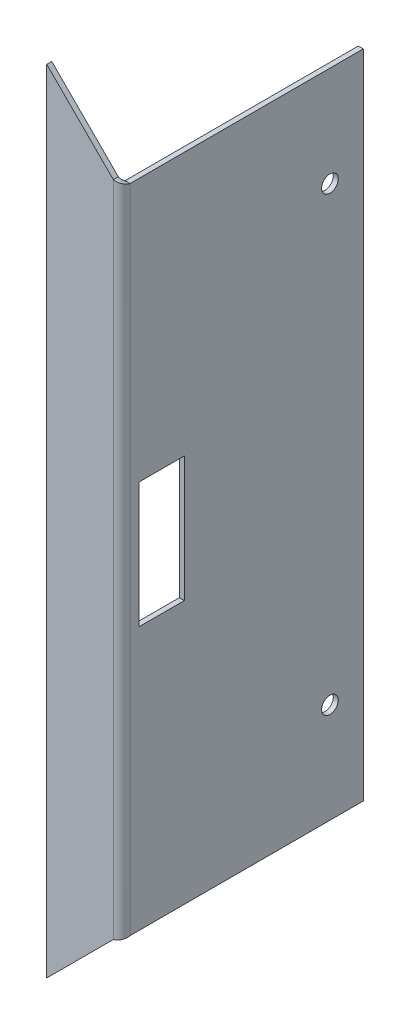
ISO-10303-21;
HEADER;
FILE_DESCRIPTION(('STEP AP214'),'2;1');
FILE_NAME('part.step','',(''),(''),'','','');
FILE_SCHEMA(('AUTOMOTIVE_DESIGN { 1 0 10303 214 1 1 1 1 }'));
ENDSEC;
DATA;
#1=APPLICATION_CONTEXT('core data for automotive mechanical design processes');
#2=APPLICATION_PROTOCOL_DEFINITION('international standard','automotive_design',2000,#1);
#3=PRODUCT_CONTEXT('',#1,'mechanical');
#4=PRODUCT('Part','Part','',(#3));
#5=PRODUCT_RELATED_PRODUCT_CATEGORY('part','',(#4));
#6=PRODUCT_DEFINITION_FORMATION('','',#4);
#7=PRODUCT_DEFINITION_CONTEXT('part definition',#1,'design');
#8=PRODUCT_DEFINITION('design','',#6,#7);
#9=PRODUCT_DEFINITION_SHAPE('','',#8);
#10=(LENGTH_UNIT() NAMED_UNIT(*) SI_UNIT(.MILLI.,.METRE.));
#11=(NAMED_UNIT(*) PLANE_ANGLE_UNIT() SI_UNIT($,.RADIAN.));
#12=(NAMED_UNIT(*) SI_UNIT($,.STERADIAN.) SOLID_ANGLE_UNIT());
#13=UNCERTAINTY_MEASURE_WITH_UNIT(LENGTH_MEASURE(1.E-05),#10,'distance_accuracy_value','');
#14=(GEOMETRIC_REPRESENTATION_CONTEXT(3) GLOBAL_UNCERTAINTY_ASSIGNED_CONTEXT((#13)) GLOBAL_UNIT_ASSIGNED_CONTEXT((#10,
#11,#12)) REPRESENTATION_CONTEXT('',''));
#15=CARTESIAN_POINT('',(0.,0.,0.));
#16=DIRECTION('',(0.,0.,1.));
#17=DIRECTION('',(1.,0.,0.));
#18=AXIS2_PLACEMENT_3D('',#15,#16,#17);
#19=CARTESIAN_POINT('',(366.499995353665,42.4999999999998,-5.93079247326395E-13));
#20=DIRECTION('',(0.,0.,1.));
#21=DIRECTION('',(1.,0.,0.));
#22=AXIS2_PLACEMENT_3D('',#19,#20,#21);
#23=PLANE('',#22);
#24=DIRECTION('',(0.,1.,0.));
#25=VECTOR('',#24,1.);
#26=CARTESIAN_POINT('',(364.999995353665,42.4999999999998,-5.98200821102928E-13));
#27=LINE('',#26,#25);
#28=CARTESIAN_POINT('',(364.999995353665,42.4999999999998,-5.98200821102928E-13));
#29=VERTEX_POINT('',#28);
#30=CARTESIAN_POINT('',(364.999995353665,238.,-5.98200821102928E-13));
#31=VERTEX_POINT('',#30);
#32=EDGE_CURVE('E237',#29,#31,#27,.T.);
#33=ORIENTED_EDGE('',*,*,#32,.T.);
#34=DIRECTION('',(-1.,0.,0.));
#35=VECTOR('',#34,1.);
#36=CARTESIAN_POINT('',(366.499995353665,238.,-5.93079247326395E-13));
#37=LINE('',#36,#35);
#38=CARTESIAN_POINT('',(366.499995353665,238.,-5.93079247326395E-13));
#39=VERTEX_POINT('',#38);
#40=EDGE_CURVE('E13',#39,#31,#37,.T.);
#41=ORIENTED_EDGE('',*,*,#40,.F.);
#42=DIRECTION('',(0.,1.,0.));
#43=VECTOR('',#42,1.);
#44=CARTESIAN_POINT('',(366.499995353665,42.4999999999998,-5.93079247326395E-13));
#45=LINE('',#44,#43);
#46=CARTESIAN_POINT('',(366.499995353665,42.4999999999998,-5.93079247326395E-13));
#47=VERTEX_POINT('',#46);
#48=EDGE_CURVE('E277',#47,#39,#45,.T.);
#49=ORIENTED_EDGE('',*,*,#48,.F.);
#50=DIRECTION('',(-1.,0.,0.));
#51=VECTOR('',#50,1.);
#52=CARTESIAN_POINT('',(366.499995353665,42.4999999999998,-5.93079247326395E-13));
#53=LINE('',#52,#51);
#54=EDGE_CURVE('E325',#47,#29,#53,.T.);
#55=ORIENTED_EDGE('',*,*,#54,.T.);
#56=EDGE_LOOP('',(#33,#41,#49,#55));
#57=FACE_BOUND('',#56,.T.);
#58=ADVANCED_FACE('F59',(#57),#23,.F.);
#59=CARTESIAN_POINT('',(366.499995353665,238.,-5.93079247326395E-13));
#60=DIRECTION('',(0.,-1.,0.));
#61=DIRECTION('',(0.,0.,-1.));
#62=AXIS2_PLACEMENT_3D('',#59,#60,#61);
#63=PLANE('',#62);
#64=DIRECTION('',(0.,0.,1.));
#65=VECTOR('',#64,1.);
#66=CARTESIAN_POINT('',(364.999995353665,238.,-5.98200821102928E-13));
#67=LINE('',#66,#65);
#68=CARTESIAN_POINT('',(364.999995353665,238.,70.));
#69=VERTEX_POINT('',#68);
#70=EDGE_CURVE('E309',#31,#69,#67,.T.);
#71=ORIENTED_EDGE('',*,*,#70,.T.);
#72=DIRECTION('',(-1.,0.,0.));
#73=VECTOR('',#72,1.);
#74=CARTESIAN_POINT('',(366.499995353665,238.,70.));
#75=LINE('',#74,#73);
#76=CARTESIAN_POINT('',(366.499995353665,238.,70.));
#77=VERTEX_POINT('',#76);
#78=EDGE_CURVE('E66',#77,#69,#75,.T.);
#79=ORIENTED_EDGE('',*,*,#78,.F.);
#80=DIRECTION('',(0.,0.,1.));
#81=VECTOR('',#80,1.);
#82=CARTESIAN_POINT('',(366.499995353665,238.,-5.93079247326395E-13));
#83=LINE('',#82,#81);
#84=EDGE_CURVE('E359',#39,#77,#83,.T.);
#85=ORIENTED_EDGE('',*,*,#84,.F.);
#86=ORIENTED_EDGE('',*,*,#40,.T.);
#87=EDGE_LOOP('',(#71,#79,#85,#86));
#88=FACE_BOUND('',#87,.T.);
#89=ADVANCED_FACE('F299',(#88),#63,.F.);
#90=CARTESIAN_POINT('',(366.499995353665,42.4999999999998,-5.93079247326395E-13));
#91=DIRECTION('',(0.,1.,0.));
#92=DIRECTION('',(0.,0.,1.));
#93=AXIS2_PLACEMENT_3D('',#90,#91,#92);
#94=PLANE('',#93);
#95=DIRECTION('',(0.,0.,-1.));
#96=VECTOR('',#95,1.);
#97=CARTESIAN_POINT('',(364.999995353665,42.4999999999998,-5.98200821102928E-13));
#98=LINE('',#97,#96);
#99=CARTESIAN_POINT('',(364.999995353665,42.4999999999998,70.));
#100=VERTEX_POINT('',#99);
#101=EDGE_CURVE('E318',#100,#29,#98,.T.);
#102=ORIENTED_EDGE('',*,*,#101,.T.);
#103=ORIENTED_EDGE('',*,*,#54,.F.);
#104=DIRECTION('',(0.,0.,-1.));
#105=VECTOR('',#104,1.);
#106=CARTESIAN_POINT('',(366.499995353665,42.4999999999998,-5.93079247326395E-13));
#107=LINE('',#106,#105);
#108=CARTESIAN_POINT('',(366.499995353665,42.4999999999998,70.));
#109=VERTEX_POINT('',#108);
#110=EDGE_CURVE('E329',#109,#47,#107,.T.);
#111=ORIENTED_EDGE('',*,*,#110,.F.);
#112=DIRECTION('',(-1.,0.,0.));
#113=VECTOR('',#112,1.);
#114=CARTESIAN_POINT('',(366.499995353665,42.4999999999998,70.));
#115=LINE('',#114,#113);
#116=EDGE_CURVE('E328',#109,#100,#115,.T.);
#117=ORIENTED_EDGE('',*,*,#116,.T.);
#118=EDGE_LOOP('',(#102,#103,#111,#117));
#119=FACE_BOUND('',#118,.T.);
#120=ADVANCED_FACE('F294',(#119),#94,.F.);
#121=CARTESIAN_POINT('',(366.499995353665,0.,1.45237656959693E-12));
#122=DIRECTION('',(1.,0.,0.));
#123=DIRECTION('',(0.,0.,-1.));
#124=AXIS2_PLACEMENT_3D('',#121,#122,#123);
#125=PLANE('',#124);
#126=DIRECTION('',(0.,0.,1.));
#127=VECTOR('',#126,1.);
#128=CARTESIAN_POINT('',(366.499995353665,159.05,53.6999999999928));
#129=LINE('',#128,#127);
#130=CARTESIAN_POINT('',(366.499995353665,159.05,53.6999999999928));
#131=VERTEX_POINT('',#130);
#132=CARTESIAN_POINT('',(366.499995353665,159.05,67.2999999999928));
#133=VERTEX_POINT('',#132);
#134=EDGE_CURVE('E73',#131,#133,#129,.T.);
#135=ORIENTED_EDGE('',*,*,#134,.F.);
#136=DIRECTION('',(0.,1.,0.));
#137=VECTOR('',#136,1.);
#138=CARTESIAN_POINT('',(366.499995353665,121.45,53.6999999999928));
#139=LINE('',#138,#137);
#140=CARTESIAN_POINT('',(366.499995353665,121.45,53.6999999999928));
#141=VERTEX_POINT('',#140);
#142=EDGE_CURVE('E165',#141,#131,#139,.T.);
#143=ORIENTED_EDGE('',*,*,#142,.F.);
#144=DIRECTION('',(0.,0.,-1.));
#145=VECTOR('',#144,1.);
#146=CARTESIAN_POINT('',(366.499995353665,121.45,67.2999999999928));
#147=LINE('',#146,#145);
#148=CARTESIAN_POINT('',(366.499995353665,121.45,67.2999999999928));
#149=VERTEX_POINT('',#148);
#150=EDGE_CURVE('E168',#149,#141,#147,.T.);
#151=ORIENTED_EDGE('',*,*,#150,.F.);
#152=DIRECTION('',(0.,-1.,0.));
#153=VECTOR('',#152,1.);
#154=CARTESIAN_POINT('',(366.499995353665,159.05,67.2999999999928));
#155=LINE('',#154,#153);
#156=EDGE_CURVE('E174',#133,#149,#155,.T.);
#157=ORIENTED_EDGE('',*,*,#156,.F.);
#158=EDGE_LOOP('',(#135,#143,#151,#157));
#159=FACE_BOUND('',#158,.T.);
#160=CARTESIAN_POINT('',(366.499995353665,208.,10.0000000000015));
#161=DIRECTION('',(1.,0.,0.));
#162=DIRECTION('',(0.,0.,-1.));
#163=AXIS2_PLACEMENT_3D('',#160,#161,#162);
#164=CIRCLE('',#163,2.5);
#165=CARTESIAN_POINT('',(366.499995353665,208.,7.50000000000145));
#166=VERTEX_POINT('',#165);
#167=EDGE_CURVE('E188',#166,#166,#164,.T.);
#168=ORIENTED_EDGE('',*,*,#167,.F.);
#169=EDGE_LOOP('',(#168));
#170=FACE_BOUND('',#169,.T.);
#171=CARTESIAN_POINT('',(366.499995353665,72.4999999999998,10.0000000000015));
#172=DIRECTION('',(1.,0.,0.));
#173=DIRECTION('',(0.,0.,1.));
#174=AXIS2_PLACEMENT_3D('',#171,#172,#173);
#175=CIRCLE('',#174,2.5);
#176=CARTESIAN_POINT('',(366.499995353665,72.4999999999998,12.5000000000015));
#177=VERTEX_POINT('',#176);
#178=EDGE_CURVE('E180',#177,#177,#175,.T.);
#179=ORIENTED_EDGE('',*,*,#178,.F.);
#180=EDGE_LOOP('',(#179));
#181=FACE_BOUND('',#180,.T.);
#182=ORIENTED_EDGE('',*,*,#48,.T.);
#183=ORIENTED_EDGE('',*,*,#84,.T.);
#184=DIRECTION('',(0.,-1.,0.));
#185=VECTOR('',#184,1.);
#186=CARTESIAN_POINT('',(366.499995353665,42.4999999999998,70.));
#187=LINE('',#186,#185);
#188=EDGE_CURVE('E356',#77,#109,#187,.T.);
#189=ORIENTED_EDGE('',*,*,#188,.T.);
#190=ORIENTED_EDGE('',*,*,#110,.T.);
#191=EDGE_LOOP('',(#182,#183,#189,#190));
#192=FACE_BOUND('',#191,.T.);
#193=ADVANCED_FACE('F285',(#159,#170,#181,#192),#125,.T.);
#194=CARTESIAN_POINT('',(364.999995353665,0.,1.44725499582039E-12));
#195=DIRECTION('',(1.,0.,0.));
#196=DIRECTION('',(0.,0.,-1.));
#197=AXIS2_PLACEMENT_3D('',#194,#195,#196);
#198=PLANE('',#197);
#199=DIRECTION('',(0.,1.,0.));
#200=VECTOR('',#199,1.);
#201=CARTESIAN_POINT('',(364.999995353665,121.45,53.6999999999928));
#202=LINE('',#201,#200);
#203=CARTESIAN_POINT('',(364.999995353665,121.45,53.6999999999928));
#204=VERTEX_POINT('',#203);
#205=CARTESIAN_POINT('',(364.999995353665,159.05,53.6999999999928));
#206=VERTEX_POINT('',#205);
#207=EDGE_CURVE('E155',#204,#206,#202,.T.);
#208=ORIENTED_EDGE('',*,*,#207,.T.);
#209=DIRECTION('',(0.,0.,1.));
#210=VECTOR('',#209,1.);
#211=CARTESIAN_POINT('',(364.999995353665,159.05,53.6999999999928));
#212=LINE('',#211,#210);
#213=CARTESIAN_POINT('',(364.999995353665,159.05,67.2999999999928));
#214=VERTEX_POINT('',#213);
#215=EDGE_CURVE('E149',#206,#214,#212,.T.);
#216=ORIENTED_EDGE('',*,*,#215,.T.);
#217=DIRECTION('',(0.,-1.,0.));
#218=VECTOR('',#217,1.);
#219=CARTESIAN_POINT('',(364.999995353665,159.05,67.2999999999928));
#220=LINE('',#219,#218);
#221=CARTESIAN_POINT('',(364.999995353665,121.45,67.2999999999928));
#222=VERTEX_POINT('',#221);
#223=EDGE_CURVE('E158',#214,#222,#220,.T.);
#224=ORIENTED_EDGE('',*,*,#223,.T.);
#225=DIRECTION('',(0.,0.,-1.));
#226=VECTOR('',#225,1.);
#227=CARTESIAN_POINT('',(364.999995353665,121.45,67.2999999999928));
#228=LINE('',#227,#226);
#229=EDGE_CURVE('E81',#222,#204,#228,.T.);
#230=ORIENTED_EDGE('',*,*,#229,.T.);
#231=EDGE_LOOP('',(#208,#216,#224,#230));
#232=FACE_BOUND('',#231,.T.);
#233=CARTESIAN_POINT('',(364.999995353665,208.,10.0000000000014));
#234=DIRECTION('',(1.,0.,0.));
#235=DIRECTION('',(0.,0.,-1.));
#236=AXIS2_PLACEMENT_3D('',#233,#234,#235);
#237=CIRCLE('',#236,2.5);
#238=CARTESIAN_POINT('',(364.999995353665,208.,7.50000000000145));
#239=VERTEX_POINT('',#238);
#240=EDGE_CURVE('E184',#239,#239,#237,.T.);
#241=ORIENTED_EDGE('',*,*,#240,.T.);
#242=EDGE_LOOP('',(#241));
#243=FACE_BOUND('',#242,.T.);
#244=CARTESIAN_POINT('',(364.999995353665,72.4999999999998,10.0000000000014));
#245=DIRECTION('',(1.,0.,0.));
#246=DIRECTION('',(0.,0.,1.));
#247=AXIS2_PLACEMENT_3D('',#244,#245,#246);
#248=CIRCLE('',#247,2.5);
#249=CARTESIAN_POINT('',(364.999995353665,72.4999999999998,12.5000000000014));
#250=VERTEX_POINT('',#249);
#251=EDGE_CURVE('E191',#250,#250,#248,.T.);
#252=ORIENTED_EDGE('',*,*,#251,.T.);
#253=EDGE_LOOP('',(#252));
#254=FACE_BOUND('',#253,.T.);
#255=ORIENTED_EDGE('',*,*,#32,.F.);
#256=ORIENTED_EDGE('',*,*,#101,.F.);
#257=DIRECTION('',(0.,-1.,0.));
#258=VECTOR('',#257,1.);
#259=CARTESIAN_POINT('',(364.999995353665,42.4999999999998,70.));
#260=LINE('',#259,#258);
#261=EDGE_CURVE('E315',#69,#100,#260,.T.);
#262=ORIENTED_EDGE('',*,*,#261,.F.);
#263=ORIENTED_EDGE('',*,*,#70,.F.);
#264=EDGE_LOOP('',(#255,#256,#262,#263));
#265=FACE_BOUND('',#264,.T.);
#266=ADVANCED_FACE('F162',(#232,#243,#254,#265),#198,.F.);
#267=CARTESIAN_POINT('',(366.514995353665,42.4999999999998,70.));
#268=CARTESIAN_POINT('',(366.514995353665,42.4166525226702,70.3292685254162));
#269=CARTESIAN_POINT('',(366.449536635485,42.3333333333331,70.6582959291636));
#270=CARTESIAN_POINT('',(366.197568120376,42.1666666666665,71.2666017356328));
#271=CARTESIAN_POINT('',(366.011157462296,42.0833333333331,71.5455850007369));
#272=CARTESIAN_POINT('',(365.545580354402,41.9166666666665,72.0111621086314));
#273=CARTESIAN_POINT('',(365.266597089298,41.8333333333331,72.1975727667109));
#274=CARTESIAN_POINT('',(364.658291282828,41.6666666666665,72.4495412818208));
#275=CARTESIAN_POINT('',(364.329263879081,41.5833474773294,72.515));
#276=CARTESIAN_POINT('',(363.999995353665,41.4999999999998,72.515));
#277=CARTESIAN_POINT('',(366.499995353665,42.4999999999998,70.));
#278=CARTESIAN_POINT('',(366.499995353665,42.4166525568521,70.3273046438602));
#279=CARTESIAN_POINT('',(366.434927045335,42.3333333333331,70.6543697108982));
#280=CARTESIAN_POINT('',(366.18446132455,42.1666666666665,71.2590474509273));
#281=CARTESIAN_POINT('',(365.99916245966,42.0833333333331,71.5363667999373));
#282=CARTESIAN_POINT('',(365.536362153602,41.9166666666665,71.9991671059954));
#283=CARTESIAN_POINT('',(365.259042804592,41.8333333333331,72.1844659708856));
#284=CARTESIAN_POINT('',(364.654365064563,41.6666666666665,72.4349316916708));
#285=CARTESIAN_POINT('',(364.327299997525,41.5833474431475,72.5));
#286=CARTESIAN_POINT('',(363.999995353665,41.4999999999998,72.5));
#287=CARTESIAN_POINT('',(364.999995353665,42.4999999999998,70.));
#288=CARTESIAN_POINT('',(364.999995353665,42.4166559750445,70.1309164882601));
#289=CARTESIAN_POINT('',(364.973968030333,42.3333333333331,70.2617478843593));
#290=CARTESIAN_POINT('',(364.873781742019,42.1666666666665,70.5036189803709));
#291=CARTESIAN_POINT('',(364.799662196063,42.0833333333331,70.6145467199749));
#292=CARTESIAN_POINT('',(364.61454207364,41.9166666666665,70.7996668423982));
#293=CARTESIAN_POINT('',(364.503614334036,41.8333333333331,70.8737863883543));
#294=CARTESIAN_POINT('',(364.261743238024,41.6666666666665,70.9739726766683));
#295=CARTESIAN_POINT('',(364.130911841925,41.5833440249552,71.));
#296=CARTESIAN_POINT('',(363.999995353665,41.4999999999998,71.));
#297=CARTESIAN_POINT('',(364.984845353665,42.4999999999998,70.));
#298=CARTESIAN_POINT('',(364.984845353665,42.4166560095682,70.1289329678885));
#299=CARTESIAN_POINT('',(364.959212344281,42.3333333333331,70.2577824039113));
#300=CARTESIAN_POINT('',(364.860543878235,42.1666666666665,70.4959891528183));
#301=CARTESIAN_POINT('',(364.787547243401,42.0833333333331,70.6052363371673));
#302=CARTESIAN_POINT('',(364.605231690832,41.9166666666665,70.7875518897359));
#303=CARTESIAN_POINT('',(364.495984506483,41.8333333333331,70.8605485245707));
#304=CARTESIAN_POINT('',(364.257777757576,41.6666666666665,70.9592169906168));
#305=CARTESIAN_POINT('',(364.128928321553,41.5833439904314,70.98485));
#306=CARTESIAN_POINT('',(363.999995353665,41.4999999999998,70.98485));
#307=B_SPLINE_SURFACE_WITH_KNOTS('',1,3,((#267,#268,#269,#270,#271,#272,#273,#274,#275,#276),
(#277,#278,#279,#280,#281,#282,#283,#284,#285,#286),(#287,#288,#289,#290,#291,#292,#293,#294,
#295,#296),(#297,#298,#299,#300,#301,#302,#303,#304,#305,#306)),.UNSPECIFIED.,.F.,.F.,.F.,(2,1,
1,2),(4,2,2,2,4),(-0.01,0.,1.,1.0101),(0.,0.25,0.5,0.75,1.),.UNSPECIFIED.);
#308=DIRECTION('',(0.,0.,1.));
#309=VECTOR('',#308,1.);
#310=CARTESIAN_POINT('',(363.999995353665,41.4999999999998,72.5));
#311=LINE('',#310,#309);
#312=CARTESIAN_POINT('',(363.999995353665,41.4999999999998,71.));
#313=VERTEX_POINT('',#312);
#314=CARTESIAN_POINT('',(363.999995353665,41.4999999999998,72.5));
#315=VERTEX_POINT('',#314);
#316=EDGE_CURVE('E187',#313,#315,#311,.T.);
#317=CARTESIAN_POINT('',(364.999995353665,42.4999999999998,70.));
#318=CARTESIAN_POINT('',(365.000002946823,42.4771041033137,70.0359623640316));
#319=CARTESIAN_POINT('',(364.998055584275,42.4542101908791,70.0719230662516));
#320=CARTESIAN_POINT('',(364.990307411007,42.4084238178259,70.1434269853173));
#321=CARTESIAN_POINT('',(364.984506680942,42.385531357187,70.1789702108854));
#322=CARTESIAN_POINT('',(364.969119692587,42.3397784922079,70.2491742629144));
#323=CARTESIAN_POINT('',(364.959539082311,42.316918090877,70.283836324158));
#324=CARTESIAN_POINT('',(364.936715417127,42.2712046323273,70.3519180548062));
#325=CARTESIAN_POINT('',(364.923472724269,42.2483515746061,70.3853378466574));
#326=CARTESIAN_POINT('',(364.880560068254,42.1829996818203,70.4785905019846));
#327=CARTESIAN_POINT('',(364.846546003369,42.1404736576078,70.536474972226));
#328=CARTESIAN_POINT('',(364.767717741439,42.0554642741546,70.6442546987734));
#329=CARTESIAN_POINT('',(364.722909798417,42.0129809044608,70.6941545536408));
#330=CARTESIAN_POINT('',(364.624265353154,41.9280157609614,70.7840518167648));
#331=CARTESIAN_POINT('',(364.570429387567,41.8855339872108,70.8240498132681));
#332=CARTESIAN_POINT('',(364.455855038607,41.8005502976183,70.8925518310957));
#333=CARTESIAN_POINT('',(364.395114738346,41.7580483794611,70.9210526503537));
#334=CARTESIAN_POINT('',(364.278909198807,41.6796152121595,70.9619730628128));
#335=CARTESIAN_POINT('',(364.224072091478,41.6436800430418,70.9761932254668));
#336=CARTESIAN_POINT('',(364.112829436643,41.5718334030419,70.995225317137));
#337=CARTESIAN_POINT('',(364.056424975373,41.5359219325751,71.0000436048202));
#338=CARTESIAN_POINT('',(363.999995353665,41.4999999999998,71.));
#339=B_SPLINE_CURVE_WITH_KNOTS('',3,(#317,#318,#319,#320,#321,#322,#323,#324,#325,#326,#327,
#328,#329,#330,#331,#332,#333,#334,#335,#336,#337,#338),.UNSPECIFIED.,.F.,.F.,(4,2,2,2,2,2,2,2,
2,2,4),(0.,0.12784826923805,0.255693862565105,0.383349144191335,0.510991809697574,
0.748186370781013,0.985243829392242,1.22228720158421,1.45939654696439,1.65999150543362,
1.86045075062561),.UNSPECIFIED.);
#340=EDGE_CURVE('E265',#100,#313,#339,.T.);
#341=CARTESIAN_POINT('',(366.499995353665,42.4999999999998,70.));
#342=CARTESIAN_POINT('',(366.499996141785,42.4842259281839,70.0619420126651));
#343=CARTESIAN_POINT('',(366.497692493919,42.4684568663612,70.1238648320016));
#344=CARTESIAN_POINT('',(366.488498336594,42.4369213704784,70.2473606134723));
#345=CARTESIAN_POINT('',(366.481608453156,42.4211549363533,70.3089336221991));
#346=CARTESIAN_POINT('',(366.454095139146,42.3738482791481,70.4926620216009));
#347=CARTESIAN_POINT('',(366.426628027661,42.342294466197,70.6138515388052));
#348=CARTESIAN_POINT('',(366.347829630946,42.2737958692236,70.8710428930534));
#349=CARTESIAN_POINT('',(366.293227675132,42.2368493147414,71.00604666366));
#350=CARTESIAN_POINT('',(366.161461522063,42.1629602592777,71.2645614850314));
#351=CARTESIAN_POINT('',(366.084295329462,42.1260177589439,71.3880715181361));
#352=CARTESIAN_POINT('',(365.909739702014,42.0521298366632,71.619853004984));
#353=CARTESIAN_POINT('',(365.812351216395,42.0151844149348,71.7281251735887));
#354=CARTESIAN_POINT('',(365.600275141455,41.9412909781256,71.9261761161815));
#355=CARTESIAN_POINT('',(365.485585449409,41.904342963276,72.0159526391363));
#356=CARTESIAN_POINT('',(365.242374862905,41.8304413261879,72.1742957829677));
#357=CARTESIAN_POINT('',(365.113850967775,41.7934877044761,72.2428577898197));
#358=CARTESIAN_POINT('',(364.846891063402,41.7195871159681,72.35664808305));
#359=CARTESIAN_POINT('',(364.708460623202,41.6826401569578,72.4018893638212));
#360=CARTESIAN_POINT('',(364.474276488773,41.6214091202915,72.4564586315939));
#361=CARTESIAN_POINT('',(364.380095462949,41.5971101624225,72.472775130013));
#362=CARTESIAN_POINT('',(364.190621102104,41.5485450374922,72.4945452719237));
#363=CARTESIAN_POINT('',(364.095329516961,41.5242788723565,72.5000141546942));
#364=CARTESIAN_POINT('',(363.999995353665,41.4999999999998,72.5));
#365=B_SPLINE_CURVE_WITH_KNOTS('',3,(#341,#342,#343,#344,#345,#346,#347,#348,#349,#350,#351,
#352,#353,#354,#355,#356,#357,#358,#359,#360,#361,#362,#363,#364),.UNSPECIFIED.,.F.,.F.,(4,2,2,
2,2,2,2,2,2,2,2,4),(0.,0.191675981569744,0.383325804689601,0.766549595110972,1.21512109780062,
1.66373227947062,2.11232240819733,2.56096710087969,3.00970930250385,3.45820119233478,
3.75350969316355,4.04840303501026),.UNSPECIFIED.);
#366=EDGE_CURVE('E228',#109,#315,#365,.T.);
#367=ORIENTED_EDGE('',*,*,#316,.F.);
#368=ORIENTED_EDGE('',*,*,#340,.F.);
#369=ORIENTED_EDGE('',*,*,#116,.F.);
#370=ORIENTED_EDGE('',*,*,#366,.T.);
#371=EDGE_LOOP('',(#367,#368,#369,#370));
#372=FACE_BOUND('',#371,.T.);
#373=ADVANCED_FACE('F245',(#372),#307,.F.);
#374=CARTESIAN_POINT('',(363.999995353665,239.,72.515));
#375=CARTESIAN_POINT('',(364.329263879081,238.91665252267,72.515));
#376=CARTESIAN_POINT('',(364.658291282828,238.833333333333,72.4495412818209));
#377=CARTESIAN_POINT('',(365.266597089297,238.666666666667,72.197572766711));
#378=CARTESIAN_POINT('',(365.545580354402,238.583333333333,72.0111621086314));
#379=CARTESIAN_POINT('',(366.011157462296,238.416666666667,71.5455850007369));
#380=CARTESIAN_POINT('',(366.197568120376,238.333333333333,71.2666017356329));
#381=CARTESIAN_POINT('',(366.449536635485,238.166666666667,70.6582959291636));
#382=CARTESIAN_POINT('',(366.514995353665,238.083347477329,70.3292685254162));
#383=CARTESIAN_POINT('',(366.514995353665,238.,70.));
#384=CARTESIAN_POINT('',(363.999995353665,239.,72.5));
#385=CARTESIAN_POINT('',(364.327299997525,238.916652556852,72.5));
#386=CARTESIAN_POINT('',(364.654365064563,238.833333333333,72.4349316916708));
#387=CARTESIAN_POINT('',(365.259042804592,238.666666666667,72.1844659708857));
#388=CARTESIAN_POINT('',(365.536362153602,238.583333333333,71.9991671059955));
#389=CARTESIAN_POINT('',(365.99916245966,238.416666666667,71.5363667999373));
#390=CARTESIAN_POINT('',(366.18446132455,238.333333333333,71.2590474509273));
#391=CARTESIAN_POINT('',(366.434927045335,238.166666666667,70.6543697108983));
#392=CARTESIAN_POINT('',(366.499995353665,238.083347443148,70.3273046438602));
#393=CARTESIAN_POINT('',(366.499995353665,238.,70.));
#394=CARTESIAN_POINT('',(363.999995353665,239.,71.));
#395=CARTESIAN_POINT('',(364.130911841925,238.916655975045,71.));
#396=CARTESIAN_POINT('',(364.261743238024,238.833333333333,70.9739726766684));
#397=CARTESIAN_POINT('',(364.503614334036,238.666666666667,70.8737863883543));
#398=CARTESIAN_POINT('',(364.61454207364,238.583333333333,70.7996668423982));
#399=CARTESIAN_POINT('',(364.799662196063,238.416666666667,70.6145467199749));
#400=CARTESIAN_POINT('',(364.873781742019,238.333333333333,70.5036189803709));
#401=CARTESIAN_POINT('',(364.973968030333,238.166666666667,70.2617478843593));
#402=CARTESIAN_POINT('',(364.999995353665,238.083344024955,70.1309164882601));
#403=CARTESIAN_POINT('',(364.999995353665,238.,70.));
#404=CARTESIAN_POINT('',(363.999995353665,239.,70.98485));
#405=CARTESIAN_POINT('',(364.128928321553,238.916656009568,70.98485));
#406=CARTESIAN_POINT('',(364.257777757576,238.833333333333,70.9592169906168));
#407=CARTESIAN_POINT('',(364.495984506483,238.666666666667,70.8605485245707));
#408=CARTESIAN_POINT('',(364.605231690832,238.583333333333,70.7875518897359));
#409=CARTESIAN_POINT('',(364.787547243401,238.416666666667,70.6052363371673));
#410=CARTESIAN_POINT('',(364.860543878235,238.333333333333,70.4959891528183));
#411=CARTESIAN_POINT('',(364.959212344281,238.166666666667,70.2577824039113));
#412=CARTESIAN_POINT('',(364.984845353665,238.083343990431,70.1289329678885));
#413=CARTESIAN_POINT('',(364.984845353665,238.,70.));
#414=B_SPLINE_SURFACE_WITH_KNOTS('',1,3,((#374,#375,#376,#377,#378,#379,#380,#381,#382,#383),
(#384,#385,#386,#387,#388,#389,#390,#391,#392,#393),(#394,#395,#396,#397,#398,#399,#400,#401,
#402,#403),(#404,#405,#406,#407,#408,#409,#410,#411,#412,#413)),.UNSPECIFIED.,.F.,.F.,.F.,(2,1,
1,2),(4,2,2,2,4),(-0.01,0.,1.,1.0101),(0.,0.25,0.5,0.75,1.),.UNSPECIFIED.);
#415=CARTESIAN_POINT('',(363.999995353665,239.,71.));
#416=CARTESIAN_POINT('',(364.035957717696,238.977104103314,71.0000075931588));
#417=CARTESIAN_POINT('',(364.071918419916,238.954210190879,70.9980602306108));
#418=CARTESIAN_POINT('',(364.143422338982,238.908423817826,70.9903120573424));
#419=CARTESIAN_POINT('',(364.17896556455,238.885531357187,70.984511327277));
#420=CARTESIAN_POINT('',(364.249169616579,238.839778492208,70.9691243389224));
#421=CARTESIAN_POINT('',(364.283831677823,238.816918090877,70.9595437286468));
#422=CARTESIAN_POINT('',(364.351913408471,238.771204632327,70.9367200634621));
#423=CARTESIAN_POINT('',(364.385333200322,238.748351574606,70.9234773706044));
#424=CARTESIAN_POINT('',(364.478585855649,238.68299968182,70.8805647145896));
#425=CARTESIAN_POINT('',(364.536470325891,238.640473657608,70.8465506497045));
#426=CARTESIAN_POINT('',(364.644250052438,238.555464274155,70.767722387774));
#427=CARTESIAN_POINT('',(364.694149907305,238.512980904461,70.7229144447521));
#428=CARTESIAN_POINT('',(364.784047170429,238.428015760962,70.6242699994897));
#429=CARTESIAN_POINT('',(364.824045166933,238.385533987211,70.5704340339023));
#430=CARTESIAN_POINT('',(364.89254718476,238.300550297618,70.4558596849428));
#431=CARTESIAN_POINT('',(364.921048004018,238.258048379461,70.395119384681));
#432=CARTESIAN_POINT('',(364.961968416477,238.17961521216,70.2789138451428));
#433=CARTESIAN_POINT('',(364.976188579131,238.143680043042,70.2240767378131));
#434=CARTESIAN_POINT('',(364.995220670802,238.071833403042,70.1128340829788));
#435=CARTESIAN_POINT('',(365.000038958485,238.035921932575,70.0564296217088));
#436=CARTESIAN_POINT('',(364.999995353665,238.,70.));
#437=B_SPLINE_CURVE_WITH_KNOTS('',3,(#415,#416,#417,#418,#419,#420,#421,#422,#423,#424,#425,
#426,#427,#428,#429,#430,#431,#432,#433,#434,#435,#436),.UNSPECIFIED.,.F.,.F.,(4,2,2,2,2,2,2,2,
2,2,4),(0.,0.127848269238049,0.255693862565122,0.383349144191338,0.510991809697536,
0.748186370780892,0.985243829392172,1.22228720158413,1.45939654696436,1.65999150543358,
1.86045075062566),.UNSPECIFIED.);
#438=CARTESIAN_POINT('',(363.999995353665,239.,71.));
#439=VERTEX_POINT('',#438);
#440=EDGE_CURVE('E198',#439,#69,#437,.T.);
#441=DIRECTION('',(0.,0.,1.));
#442=VECTOR('',#441,1.);
#443=CARTESIAN_POINT('',(363.999995353665,239.,71.0000000000001));
#444=LINE('',#443,#442);
#445=CARTESIAN_POINT('',(363.999995353665,239.,72.5));
#446=VERTEX_POINT('',#445);
#447=EDGE_CURVE('E221',#439,#446,#444,.T.);
#448=CARTESIAN_POINT('',(363.999995353665,239.,72.5));
#449=CARTESIAN_POINT('',(364.06193736633,238.984225928184,72.5000007881204));
#450=CARTESIAN_POINT('',(364.123860185666,238.968456866361,72.4976971402549));
#451=CARTESIAN_POINT('',(364.247355967137,238.936921370479,72.4885029829295));
#452=CARTESIAN_POINT('',(364.308928975864,238.921154936353,72.4816130994917));
#453=CARTESIAN_POINT('',(364.492657375265,238.873848279148,72.4540997854812));
#454=CARTESIAN_POINT('',(364.61384689247,238.842294466197,72.4266326739967));
#455=CARTESIAN_POINT('',(364.871038246718,238.773795869224,72.3478342772816));
#456=CARTESIAN_POINT('',(365.006042017325,238.736849314742,72.2932323214675));
#457=CARTESIAN_POINT('',(365.264556838696,238.662960259278,72.1614661683981));
#458=CARTESIAN_POINT('',(365.388066871801,238.626017758944,72.0842999757975));
#459=CARTESIAN_POINT('',(365.619848358649,238.552129836663,71.909744348349));
#460=CARTESIAN_POINT('',(365.728120527253,238.515184414935,71.8123558627306));
#461=CARTESIAN_POINT('',(365.926171469846,238.441290978126,71.6002797877901));
#462=CARTESIAN_POINT('',(366.015947992801,238.404342963276,71.4855900957441));
#463=CARTESIAN_POINT('',(366.174291136632,238.330441326188,71.2423795092398));
#464=CARTESIAN_POINT('',(366.242853143484,238.293487704476,71.1138556141101));
#465=CARTESIAN_POINT('',(366.356643436715,238.219587115968,70.8468957097376));
#466=CARTESIAN_POINT('',(366.401884717486,238.182640156958,70.7084652695371));
#467=CARTESIAN_POINT('',(366.456453985259,238.121409120292,70.4742811351079));
#468=CARTESIAN_POINT('',(366.472770483678,238.097110162423,70.3801001092839));
#469=CARTESIAN_POINT('',(366.494540625588,238.048545037492,70.1906257484389));
#470=CARTESIAN_POINT('',(366.500009508359,238.024278872357,70.0953341632963));
#471=CARTESIAN_POINT('',(366.499995353665,238.,70.));
#472=B_SPLINE_CURVE_WITH_KNOTS('',3,(#448,#449,#450,#451,#452,#453,#454,#455,#456,#457,#458,
#459,#460,#461,#462,#463,#464,#465,#466,#467,#468,#469,#470,#471),.UNSPECIFIED.,.F.,.F.,(4,2,2,
2,2,2,2,2,2,2,2,4),(0.,0.191675981569723,0.383325804689574,0.766549595110917,1.21512109780062,
1.66373227947077,2.11232240819743,2.56096710087977,3.00970930250394,3.45820119233474,
3.75350969316358,4.04840303501039),.UNSPECIFIED.);
#473=EDGE_CURVE('E238',#446,#77,#472,.T.);
#474=ORIENTED_EDGE('',*,*,#440,.F.);
#475=ORIENTED_EDGE('',*,*,#447,.T.);
#476=ORIENTED_EDGE('',*,*,#473,.T.);
#477=ORIENTED_EDGE('',*,*,#78,.T.);
#478=EDGE_LOOP('',(#474,#475,#476,#477));
#479=FACE_BOUND('',#478,.T.);
#480=ADVANCED_FACE('F255',(#479),#414,.F.);
#481=CARTESIAN_POINT('',(363.999995353665,239.,70.));
#482=DIRECTION('',(0.,1.,0.));
#483=DIRECTION('',(0.,0.,1.));
#484=AXIS2_PLACEMENT_3D('',#481,#482,#483);
#485=CYLINDRICAL_SURFACE('',#484,2.5);
#486=ORIENTED_EDGE('',*,*,#188,.F.);
#487=ORIENTED_EDGE('',*,*,#473,.F.);
#488=DIRECTION('',(0.,1.,0.));
#489=VECTOR('',#488,1.);
#490=CARTESIAN_POINT('',(363.999995353665,1.02309158431668E-13,72.5));
#491=LINE('',#490,#489);
#492=EDGE_CURVE('E218',#315,#446,#491,.T.);
#493=ORIENTED_EDGE('',*,*,#492,.F.);
#494=ORIENTED_EDGE('',*,*,#366,.F.);
#495=EDGE_LOOP('',(#486,#487,#493,#494));
#496=FACE_BOUND('',#495,.T.);
#497=ADVANCED_FACE('F250',(#496),#485,.T.);
#498=CARTESIAN_POINT('',(363.999995353665,239.,70.));
#499=DIRECTION('',(0.,1.,0.));
#500=DIRECTION('',(0.,0.,1.));
#501=AXIS2_PLACEMENT_3D('',#498,#499,#500);
#502=CYLINDRICAL_SURFACE('',#501,1.);
#503=ORIENTED_EDGE('',*,*,#261,.T.);
#504=ORIENTED_EDGE('',*,*,#340,.T.);
#505=DIRECTION('',(0.,-1.,0.));
#506=VECTOR('',#505,1.);
#507=CARTESIAN_POINT('',(363.999995353665,41.4999999999998,71.));
#508=LINE('',#507,#506);
#509=EDGE_CURVE('E224',#313,#439,#508,.F.);
#510=ORIENTED_EDGE('',*,*,#509,.T.);
#511=ORIENTED_EDGE('',*,*,#440,.T.);
#512=EDGE_LOOP('',(#503,#504,#510,#511));
#513=FACE_BOUND('',#512,.T.);
#514=ADVANCED_FACE('F254',(#513),#502,.F.);
#515=CARTESIAN_POINT('',(364.999995353665,238.,72.5));
#516=DIRECTION('',(0.707106781186547,0.707106781186548,0.));
#517=DIRECTION('',(-0.707106781186548,0.707106781186547,0.));
#518=AXIS2_PLACEMENT_3D('',#515,#516,#517);
#519=PLANE('',#518);
#520=DIRECTION('',(0.707106781186548,-0.707106781186547,0.));
#521=VECTOR('',#520,1.);
#522=CARTESIAN_POINT('',(364.999995353665,238.,72.5));
#523=LINE('',#522,#521);
#524=CARTESIAN_POINT('',(343.999995353665,259.,72.5));
#525=VERTEX_POINT('',#524);
#526=EDGE_CURVE('E202',#525,#446,#523,.T.);
#527=ORIENTED_EDGE('',*,*,#526,.T.);
#528=ORIENTED_EDGE('',*,*,#447,.F.);
#529=DIRECTION('',(-0.707106781186548,0.707106781186547,0.));
#530=VECTOR('',#529,1.);
#531=CARTESIAN_POINT('',(301.499997676832,301.499997676833,71.));
#532=LINE('',#531,#530);
#533=CARTESIAN_POINT('',(343.999995353665,259.,71.));
#534=VERTEX_POINT('',#533);
#535=EDGE_CURVE('E210',#534,#439,#532,.F.);
#536=ORIENTED_EDGE('',*,*,#535,.F.);
#537=DIRECTION('',(0.,0.,-1.));
#538=VECTOR('',#537,1.);
#539=CARTESIAN_POINT('',(343.999995353665,259.,72.5));
#540=LINE('',#539,#538);
#541=EDGE_CURVE('E196',#525,#534,#540,.T.);
#542=ORIENTED_EDGE('',*,*,#541,.F.);
#543=EDGE_LOOP('',(#527,#528,#536,#542));
#544=FACE_BOUND('',#543,.T.);
#545=ADVANCED_FACE('F262',(#544),#519,.T.);
#546=CARTESIAN_POINT('',(343.999995353665,21.5,72.5));
#547=DIRECTION('',(0.707106781186544,-0.707106781186551,0.));
#548=DIRECTION('',(0.707106781186551,0.707106781186544,0.));
#549=AXIS2_PLACEMENT_3D('',#546,#547,#548);
#550=PLANE('',#549);
#551=DIRECTION('',(0.707106781186551,0.707106781186544,0.));
#552=VECTOR('',#551,1.);
#553=CARTESIAN_POINT('',(161.249997676831,-161.249997676832,70.9999999999999));
#554=LINE('',#553,#552);
#555=CARTESIAN_POINT('',(343.999995353665,21.5,71.));
#556=VERTEX_POINT('',#555);
#557=EDGE_CURVE('E216',#313,#556,#554,.F.);
#558=ORIENTED_EDGE('',*,*,#557,.F.);
#559=ORIENTED_EDGE('',*,*,#316,.T.);
#560=DIRECTION('',(-0.707106781186551,-0.707106781186544,0.));
#561=VECTOR('',#560,1.);
#562=CARTESIAN_POINT('',(343.999995353665,21.5,72.5));
#563=LINE('',#562,#561);
#564=CARTESIAN_POINT('',(343.999995353665,21.5,72.5));
#565=VERTEX_POINT('',#564);
#566=EDGE_CURVE('E208',#315,#565,#563,.T.);
#567=ORIENTED_EDGE('',*,*,#566,.T.);
#568=DIRECTION('',(0.,0.,-1.));
#569=VECTOR('',#568,1.);
#570=CARTESIAN_POINT('',(343.999995353665,21.5,72.5));
#571=LINE('',#570,#569);
#572=EDGE_CURVE('E199',#565,#556,#571,.T.);
#573=ORIENTED_EDGE('',*,*,#572,.T.);
#574=EDGE_LOOP('',(#558,#559,#567,#573));
#575=FACE_BOUND('',#574,.T.);
#576=ADVANCED_FACE('F257',(#575),#550,.T.);
#577=CARTESIAN_POINT('',(0.,0.,72.4999999999998));
#578=DIRECTION('',(0.,0.,1.));
#579=DIRECTION('',(1.,0.,0.));
#580=AXIS2_PLACEMENT_3D('',#577,#578,#579);
#581=PLANE('',#580);
#582=ORIENTED_EDGE('',*,*,#566,.F.);
#583=ORIENTED_EDGE('',*,*,#492,.T.);
#584=ORIENTED_EDGE('',*,*,#526,.F.);
#585=DIRECTION('',(0.,1.,0.));
#586=VECTOR('',#585,1.);
#587=CARTESIAN_POINT('',(343.999995353665,259.,72.5));
#588=LINE('',#587,#586);
#589=EDGE_CURVE('E205',#565,#525,#588,.T.);
#590=ORIENTED_EDGE('',*,*,#589,.F.);
#591=EDGE_LOOP('',(#582,#583,#584,#590));
#592=FACE_BOUND('',#591,.T.);
#593=ADVANCED_FACE('F350',(#592),#581,.T.);
#594=CARTESIAN_POINT('',(0.,0.,70.9999999999998));
#595=DIRECTION('',(0.,0.,1.));
#596=DIRECTION('',(1.,0.,0.));
#597=AXIS2_PLACEMENT_3D('',#594,#595,#596);
#598=PLANE('',#597);
#599=ORIENTED_EDGE('',*,*,#509,.F.);
#600=ORIENTED_EDGE('',*,*,#557,.T.);
#601=DIRECTION('',(0.,-1.,0.));
#602=VECTOR('',#601,1.);
#603=CARTESIAN_POINT('',(343.999995353665,0.,71.));
#604=LINE('',#603,#602);
#605=EDGE_CURVE('E213',#556,#534,#604,.F.);
#606=ORIENTED_EDGE('',*,*,#605,.T.);
#607=ORIENTED_EDGE('',*,*,#535,.T.);
#608=EDGE_LOOP('',(#599,#600,#606,#607));
#609=FACE_BOUND('',#608,.T.);
#610=ADVANCED_FACE('F337',(#609),#598,.F.);
#611=CARTESIAN_POINT('',(343.999995353665,259.,72.5));
#612=DIRECTION('',(-1.,0.,0.));
#613=DIRECTION('',(0.,0.,1.));
#614=AXIS2_PLACEMENT_3D('',#611,#612,#613);
#615=PLANE('',#614);
#616=ORIENTED_EDGE('',*,*,#605,.F.);
#617=ORIENTED_EDGE('',*,*,#572,.F.);
#618=ORIENTED_EDGE('',*,*,#589,.T.);
#619=ORIENTED_EDGE('',*,*,#541,.T.);
#620=EDGE_LOOP('',(#616,#617,#618,#619));
#621=FACE_BOUND('',#620,.T.);
#622=ADVANCED_FACE('F346',(#621),#615,.T.);
#623=CARTESIAN_POINT('',(364.999995353665,72.4999999999998,10.0000000000014));
#624=DIRECTION('',(1.,0.,0.));
#625=DIRECTION('',(0.,0.,-1.));
#626=AXIS2_PLACEMENT_3D('',#623,#624,#625);
#627=CYLINDRICAL_SURFACE('',#626,2.5);
#628=ORIENTED_EDGE('',*,*,#251,.F.);
#629=EDGE_LOOP('',(#628));
#630=FACE_BOUND('',#629,.T.);
#631=ORIENTED_EDGE('',*,*,#178,.T.);
#632=EDGE_LOOP('',(#631));
#633=FACE_BOUND('',#632,.T.);
#634=ADVANCED_FACE('F410',(#630,#633),#627,.F.);
#635=CARTESIAN_POINT('',(364.999995353665,208.,10.0000000000014));
#636=DIRECTION('',(1.,0.,0.));
#637=DIRECTION('',(0.,0.,-1.));
#638=AXIS2_PLACEMENT_3D('',#635,#636,#637);
#639=CYLINDRICAL_SURFACE('',#638,2.5);
#640=ORIENTED_EDGE('',*,*,#240,.F.);
#641=EDGE_LOOP('',(#640));
#642=FACE_BOUND('',#641,.T.);
#643=ORIENTED_EDGE('',*,*,#167,.T.);
#644=EDGE_LOOP('',(#643));
#645=FACE_BOUND('',#644,.T.);
#646=ADVANCED_FACE('F416',(#642,#645),#639,.F.);
#647=CARTESIAN_POINT('',(364.999995353665,159.05,53.6999999999928));
#648=DIRECTION('',(0.,1.,0.));
#649=DIRECTION('',(0.,0.,1.));
#650=AXIS2_PLACEMENT_3D('',#647,#648,#649);
#651=PLANE('',#650);
#652=ORIENTED_EDGE('',*,*,#134,.T.);
#653=DIRECTION('',(1.,0.,0.));
#654=VECTOR('',#653,1.);
#655=CARTESIAN_POINT('',(364.999995353665,159.05,67.2999999999928));
#656=LINE('',#655,#654);
#657=EDGE_CURVE('E145',#214,#133,#656,.T.);
#658=ORIENTED_EDGE('',*,*,#657,.F.);
#659=ORIENTED_EDGE('',*,*,#215,.F.);
#660=DIRECTION('',(1.,0.,0.));
#661=VECTOR('',#660,1.);
#662=CARTESIAN_POINT('',(364.999995353665,159.05,53.6999999999928));
#663=LINE('',#662,#661);
#664=EDGE_CURVE('E178',#206,#131,#663,.T.);
#665=ORIENTED_EDGE('',*,*,#664,.T.);
#666=EDGE_LOOP('',(#652,#658,#659,#665));
#667=FACE_BOUND('',#666,.T.);
#668=ADVANCED_FACE('F147',(#667),#651,.F.);
#669=CARTESIAN_POINT('',(364.999995353665,121.45,53.6999999999928));
#670=DIRECTION('',(0.,0.,-1.));
#671=DIRECTION('',(-1.,0.,0.));
#672=AXIS2_PLACEMENT_3D('',#669,#670,#671);
#673=PLANE('',#672);
#674=ORIENTED_EDGE('',*,*,#142,.T.);
#675=ORIENTED_EDGE('',*,*,#664,.F.);
#676=ORIENTED_EDGE('',*,*,#207,.F.);
#677=DIRECTION('',(1.,0.,0.));
#678=VECTOR('',#677,1.);
#679=CARTESIAN_POINT('',(364.999995353665,121.45,53.6999999999928));
#680=LINE('',#679,#678);
#681=EDGE_CURVE('E181',#204,#141,#680,.T.);
#682=ORIENTED_EDGE('',*,*,#681,.T.);
#683=EDGE_LOOP('',(#674,#675,#676,#682));
#684=FACE_BOUND('',#683,.T.);
#685=ADVANCED_FACE('F432',(#684),#673,.F.);
#686=CARTESIAN_POINT('',(364.999995353665,121.45,67.2999999999928));
#687=DIRECTION('',(0.,-1.,0.));
#688=DIRECTION('',(0.,0.,-1.));
#689=AXIS2_PLACEMENT_3D('',#686,#687,#688);
#690=PLANE('',#689);
#691=ORIENTED_EDGE('',*,*,#150,.T.);
#692=ORIENTED_EDGE('',*,*,#681,.F.);
#693=ORIENTED_EDGE('',*,*,#229,.F.);
#694=DIRECTION('',(1.,0.,0.));
#695=VECTOR('',#694,1.);
#696=CARTESIAN_POINT('',(364.999995353665,121.45,67.2999999999928));
#697=LINE('',#696,#695);
#698=EDGE_CURVE('E154',#222,#149,#697,.T.);
#699=ORIENTED_EDGE('',*,*,#698,.T.);
#700=EDGE_LOOP('',(#691,#692,#693,#699));
#701=FACE_BOUND('',#700,.T.);
#702=ADVANCED_FACE('F439',(#701),#690,.F.);
#703=CARTESIAN_POINT('',(364.999995353665,159.05,67.2999999999928));
#704=DIRECTION('',(0.,0.,1.));
#705=DIRECTION('',(1.,0.,0.));
#706=AXIS2_PLACEMENT_3D('',#703,#704,#705);
#707=PLANE('',#706);
#708=ORIENTED_EDGE('',*,*,#156,.T.);
#709=ORIENTED_EDGE('',*,*,#698,.F.);
#710=ORIENTED_EDGE('',*,*,#223,.F.);
#711=ORIENTED_EDGE('',*,*,#657,.T.);
#712=EDGE_LOOP('',(#708,#709,#710,#711));
#713=FACE_BOUND('',#712,.T.);
#714=ADVANCED_FACE('F159',(#713),#707,.F.);
#715=CLOSED_SHELL('',(#58,#89,#120,#193,#266,#373,#480,#497,#514,#545,#576,#593,#610,#622,#634,
#646,#668,#685,#702,#714));
#716=MANIFOLD_SOLID_BREP('B2',#715);
#717=ADVANCED_BREP_SHAPE_REPRESENTATION('',(#18,#716),#14);
#718=SHAPE_DEFINITION_REPRESENTATION(#9,#717);
ENDSEC;
END-ISO-10303-21;
